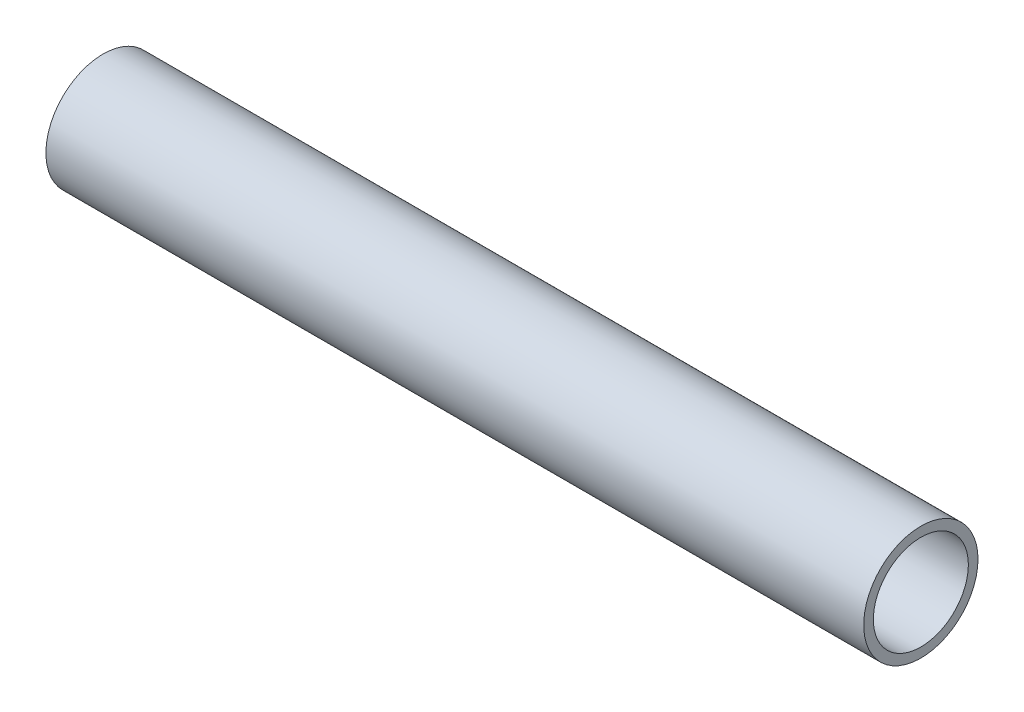
ISO-10303-21;
HEADER;
FILE_DESCRIPTION(('STEP AP214'),'2;1');
FILE_NAME('part.step','',(''),(''),'','','');
FILE_SCHEMA(('AUTOMOTIVE_DESIGN { 1 0 10303 214 1 1 1 1 }'));
ENDSEC;
DATA;
#1=APPLICATION_CONTEXT('core data for automotive mechanical design processes');
#2=APPLICATION_PROTOCOL_DEFINITION('international standard','automotive_design',2000,#1);
#3=PRODUCT_CONTEXT('',#1,'mechanical');
#4=PRODUCT('Part','Part','',(#3));
#5=PRODUCT_RELATED_PRODUCT_CATEGORY('part','',(#4));
#6=PRODUCT_DEFINITION_FORMATION('','',#4);
#7=PRODUCT_DEFINITION_CONTEXT('part definition',#1,'design');
#8=PRODUCT_DEFINITION('design','',#6,#7);
#9=PRODUCT_DEFINITION_SHAPE('','',#8);
#10=(LENGTH_UNIT() NAMED_UNIT(*) SI_UNIT(.MILLI.,.METRE.));
#11=(NAMED_UNIT(*) PLANE_ANGLE_UNIT() SI_UNIT($,.RADIAN.));
#12=(NAMED_UNIT(*) SI_UNIT($,.STERADIAN.) SOLID_ANGLE_UNIT());
#13=UNCERTAINTY_MEASURE_WITH_UNIT(LENGTH_MEASURE(1.E-05),#10,'distance_accuracy_value','');
#14=(GEOMETRIC_REPRESENTATION_CONTEXT(3) GLOBAL_UNCERTAINTY_ASSIGNED_CONTEXT((#13)) GLOBAL_UNIT_ASSIGNED_CONTEXT((#10,
#11,#12)) REPRESENTATION_CONTEXT('',''));
#15=CARTESIAN_POINT('',(0.,0.,0.));
#16=DIRECTION('',(0.,0.,1.));
#17=DIRECTION('',(1.,0.,0.));
#18=AXIS2_PLACEMENT_3D('',#15,#16,#17);
#19=CARTESIAN_POINT('',(-174.625,0.,0.));
#20=DIRECTION('',(1.,0.,0.));
#21=DIRECTION('',(0.,0.,-1.));
#22=AXIS2_PLACEMENT_3D('',#19,#20,#21);
#23=CYLINDRICAL_SURFACE('',#22,21.082);
#24=CARTESIAN_POINT('',(-95.25,0.,-21.082));
#25=CARTESIAN_POINT('',(-95.2500073037573,-0.177265588906064,-21.0819971511082));
#26=CARTESIAN_POINT('',(-95.2648956722781,-0.354633825443564,-21.0797407978607));
#27=CARTESIAN_POINT('',(-95.3240403602155,-0.704412011201185,-21.0709569196678));
#28=CARTESIAN_POINT('',(-95.3683252199961,-0.876816971803983,-21.064425243998));
#29=CARTESIAN_POINT('',(-95.4849091388346,-1.21155604974819,-21.0478246855302));
#30=CARTESIAN_POINT('',(-95.5571869641717,-1.37389769247853,-21.0377584843423));
#31=CARTESIAN_POINT('',(-95.7276530975323,-1.68412370373539,-21.0152009969064));
#32=CARTESIAN_POINT('',(-95.8258378289602,-1.83201006403648,-21.0027100454717));
#33=CARTESIAN_POINT('',(-96.0461542058056,-2.1103164343508,-20.9765819826565));
#34=CARTESIAN_POINT('',(-96.1684495601003,-2.24060616148058,-20.9629374218632));
#35=CARTESIAN_POINT('',(-96.4331633864275,-2.47889671955908,-20.9360982303561));
#36=CARTESIAN_POINT('',(-96.5755830188655,-2.58689626432783,-20.9229036256421));
#37=CARTESIAN_POINT('',(-96.8773786544134,-2.77804840978028,-20.8983859912104));
#38=CARTESIAN_POINT('',(-97.0368354067939,-2.86107486347092,-20.8870725883659));
#39=CARTESIAN_POINT('',(-97.3676295731584,-2.99911783525677,-20.8677000439257));
#40=CARTESIAN_POINT('',(-97.5389663337644,-3.05413589237424,-20.8596407235276));
#41=CARTESIAN_POINT('',(-97.8872863628436,-3.13419550245968,-20.8477621012251));
#42=CARTESIAN_POINT('',(-98.0642172558634,-3.15946016290709,-20.8439112577396));
#43=CARTESIAN_POINT('',(-98.419845943067,-3.17998699422211,-20.8407898425614));
#44=CARTESIAN_POINT('',(-98.5985436343971,-3.17525090142445,-20.8415190057945));
#45=CARTESIAN_POINT('',(-98.9510567099515,-3.13609297404926,-20.8474463775802));
#46=CARTESIAN_POINT('',(-99.1249004248299,-3.101919701057,-20.852607165254));
#47=CARTESIAN_POINT('',(-99.4643579756068,-3.00524659900985,-20.8667578327125));
#48=CARTESIAN_POINT('',(-99.6299715768266,-2.94274596272441,-20.8757478216156));
#49=CARTESIAN_POINT('',(-99.9490235812398,-2.7909340011809,-20.8965852461813));
#50=CARTESIAN_POINT('',(-100.102411162019,-2.70151746318004,-20.9084438587404));
#51=CARTESIAN_POINT('',(-100.392099144084,-2.498486828096,-20.9336742925736));
#52=CARTESIAN_POINT('',(-100.528398414064,-2.38487113028628,-20.9470462139227));
#53=CARTESIAN_POINT('',(-100.781481243325,-2.1353032656861,-20.9739618878806));
#54=CARTESIAN_POINT('',(-100.898054144489,-1.9991374095518,-20.9875060134767));
#55=CARTESIAN_POINT('',(-101.106725455512,-1.70906259522473,-21.0131148002247));
#56=CARTESIAN_POINT('',(-101.198823756631,-1.55515355820368,-21.0251794548033));
#57=CARTESIAN_POINT('',(-101.355942659601,-1.23377816277264,-21.0464826923882));
#58=CARTESIAN_POINT('',(-101.420946926471,-1.06630369822491,-21.0557195696406));
#59=CARTESIAN_POINT('',(-101.521848958346,-0.722645240857131,-21.070312259879));
#60=CARTESIAN_POINT('',(-101.557748707077,-0.546461842495156,-21.0756683373726));
#61=CARTESIAN_POINT('',(-101.599142333219,-0.192204765370484,-21.0818608911754));
#62=CARTESIAN_POINT('',(-101.604925808796,-0.0141656498471117,-21.0827404122035));
#63=CARTESIAN_POINT('',(-101.586691518388,0.340339952440575,-21.0799979514801));
#64=CARTESIAN_POINT('',(-101.562674682621,0.516806488119838,-21.0763761102388));
#65=CARTESIAN_POINT('',(-101.485762333879,0.862279899383912,-21.0650645063623));
#66=CARTESIAN_POINT('',(-101.433007989693,1.03131891039134,-21.0573946347692));
#67=CARTESIAN_POINT('',(-101.300267051749,1.35815274399449,-21.0388441665934));
#68=CARTESIAN_POINT('',(-101.220279170212,1.51594703443953,-21.0279634181826));
#69=CARTESIAN_POINT('',(-101.034662860785,1.8170851157619,-21.0040933283749));
#70=CARTESIAN_POINT('',(-100.928850826916,1.9603145348408,-20.9910891189132));
#71=CARTESIAN_POINT('',(-100.694845351182,2.22708618632573,-20.9644655933992));
#72=CARTESIAN_POINT('',(-100.566650597521,2.35062726403486,-20.9508462413297));
#73=CARTESIAN_POINT('',(-100.290229093112,2.57556977848285,-20.9243908347895));
#74=CARTESIAN_POINT('',(-100.141843493739,2.67677703259561,-20.9115622997957));
#75=CARTESIAN_POINT('',(-99.8300080053974,2.85282903090451,-20.888274456038));
#76=CARTESIAN_POINT('',(-99.6665585261644,2.92767449187153,-20.8778150828597));
#77=CARTESIAN_POINT('',(-99.3298127983176,3.04857772519442,-20.8605043047131));
#78=CARTESIAN_POINT('',(-99.156553855138,3.09473749350593,-20.8536401303661));
#79=CARTESIAN_POINT('',(-98.8046316089195,3.15728352894343,-20.8442630448294));
#80=CARTESIAN_POINT('',(-98.6259686832474,3.17367187018762,-20.8417498305174));
#81=CARTESIAN_POINT('',(-98.2702456638402,3.17616021106898,-20.8413705974415));
#82=CARTESIAN_POINT('',(-98.0931876803551,3.16256554437416,-20.8434577306442));
#83=CARTESIAN_POINT('',(-97.7439067922048,3.10612829026899,-20.8519421795031));
#84=CARTESIAN_POINT('',(-97.5716838795403,3.0632857512491,-20.8583394880282));
#85=CARTESIAN_POINT('',(-97.2370476835853,2.94967717748468,-20.874707044174));
#86=CARTESIAN_POINT('',(-97.0746269537971,2.87893265513937,-20.8846745386426));
#87=CARTESIAN_POINT('',(-96.7639105714977,2.71155871536682,-20.9070627102117));
#88=CARTESIAN_POINT('',(-96.6156154052644,2.61492840724794,-20.9194834717215));
#89=CARTESIAN_POINT('',(-96.3358087193127,2.39741725845485,-20.9455292166376));
#90=CARTESIAN_POINT('',(-96.2044739082908,2.27631033164997,-20.9591647100844));
#91=CARTESIAN_POINT('',(-95.9638828183518,2.01376149306829,-20.9860159394496));
#92=CARTESIAN_POINT('',(-95.8546316769312,1.87231486257537,-20.9992315770924));
#93=CARTESIAN_POINT('',(-95.6607669697578,1.57217776718591,-21.0238378848768));
#94=CARTESIAN_POINT('',(-95.5762935254673,1.41339594518084,-21.0352180180234));
#95=CARTESIAN_POINT('',(-95.4353412780308,1.08380087043067,-21.0547677779054));
#96=CARTESIAN_POINT('',(-95.3788335193363,0.913000272113382,-21.0629407235248));
#97=CARTESIAN_POINT('',(-95.3082168635909,0.61786433248082,-21.0732924950954));
#98=CARTESIAN_POINT('',(-95.2864189599853,0.495349503289427,-21.0765410154751));
#99=CARTESIAN_POINT('',(-95.2573080583054,0.248573261637359,-21.0808957533839));
#100=CARTESIAN_POINT('',(-95.2499948780599,0.124311871162614,-21.0820019978558));
#101=CARTESIAN_POINT('',(-95.25,0.,-21.082));
#102=B_SPLINE_CURVE_WITH_KNOTS('',3,(#24,#25,#26,#27,#28,#29,#30,#31,#32,#33,#34,#35,#36,#37,
#38,#39,#40,#41,#42,#43,#44,#45,#46,#47,#48,#49,#50,#51,#52,#53,#54,#55,#56,#57,#58,#59,#60,#61,
#62,#63,#64,#65,#66,#67,#68,#69,#70,#71,#72,#73,#74,#75,#76,#77,#78,#79,#80,#81,#82,#83,#84,#85,
#86,#87,#88,#89,#90,#91,#92,#93,#94,#95,#96,#97,#98,#99,#100,#101),.UNSPECIFIED.,.T.,.F.,(4,2,2,
2,2,2,2,2,2,2,2,2,2,2,2,2,2,2,2,2,2,2,2,2,2,2,2,2,2,2,2,2,2,2,2,2,2,2,4),(0.,0.531342512429038,
1.06320164882558,1.5946581376531,2.12604129424767,2.66116512439551,3.19631982343617,
3.73413403476704,4.27191869076775,4.80564452954641,5.33933947849273,5.86857170164552,
6.39781900700991,6.92916258470441,7.46054132064733,7.99727852314497,8.53401811031673,
9.07108083107699,9.6081069432693,10.1399593459211,10.6717951472021,11.2010416383702,
11.730313159249,12.2634633412738,12.7966447804,13.3342937698578,13.8719281396386,
14.4076397711918,14.9433140793118,15.4735585288678,16.0038021011393,16.5336376528597,
17.0634914377811,17.5984835709691,18.1336000206727,18.6716867332597,19.2092151415009,
19.5818368843675,19.9544539408189),.UNSPECIFIED.);
#103=CARTESIAN_POINT('',(-95.25,0.,-21.082));
#104=VERTEX_POINT('',#103);
#105=EDGE_CURVE('E75',#104,#104,#102,.T.);
#106=ORIENTED_EDGE('',*,*,#105,.F.);
#107=EDGE_LOOP('',(#106));
#108=FACE_BOUND('',#107,.T.);
#109=CARTESIAN_POINT('',(-146.05,0.,-21.082));
#110=CARTESIAN_POINT('',(-146.050007303757,-0.177265588906064,-21.0819971511082));
#111=CARTESIAN_POINT('',(-146.064895672278,-0.354633825443566,-21.0797407978607));
#112=CARTESIAN_POINT('',(-146.124040360215,-0.704412011201187,-21.0709569196678));
#113=CARTESIAN_POINT('',(-146.168325219996,-0.876816971803985,-21.064425243998));
#114=CARTESIAN_POINT('',(-146.284909138835,-1.21155604974819,-21.0478246855302));
#115=CARTESIAN_POINT('',(-146.357186964172,-1.37389769247854,-21.0377584843423));
#116=CARTESIAN_POINT('',(-146.527653097532,-1.6841237037354,-21.0152009969064));
#117=CARTESIAN_POINT('',(-146.62583782896,-1.8320100640365,-21.0027100454717));
#118=CARTESIAN_POINT('',(-146.846154205806,-2.11031643435081,-20.9765819826565));
#119=CARTESIAN_POINT('',(-146.9684495601,-2.24060616148059,-20.9629374218632));
#120=CARTESIAN_POINT('',(-147.233163386427,-2.47889671955909,-20.9360982303561));
#121=CARTESIAN_POINT('',(-147.375583018865,-2.58689626432784,-20.9229036256421));
#122=CARTESIAN_POINT('',(-147.677378654413,-2.77804840978029,-20.8983859912104));
#123=CARTESIAN_POINT('',(-147.836835406794,-2.86107486347093,-20.8870725883659));
#124=CARTESIAN_POINT('',(-148.167629573158,-2.99911783525678,-20.8677000439257));
#125=CARTESIAN_POINT('',(-148.338966333764,-3.05413589237425,-20.8596407235276));
#126=CARTESIAN_POINT('',(-148.687286362844,-3.13419550245969,-20.8477621012251));
#127=CARTESIAN_POINT('',(-148.864217255863,-3.15946016290709,-20.8439112577396));
#128=CARTESIAN_POINT('',(-149.219845943067,-3.17998699422211,-20.8407898425614));
#129=CARTESIAN_POINT('',(-149.398543634397,-3.17525090142445,-20.8415190057945));
#130=CARTESIAN_POINT('',(-149.751056709951,-3.13609297404926,-20.8474463775802));
#131=CARTESIAN_POINT('',(-149.92490042483,-3.101919701057,-20.852607165254));
#132=CARTESIAN_POINT('',(-150.264357975607,-3.00524659900985,-20.8667578327125));
#133=CARTESIAN_POINT('',(-150.429971576827,-2.9427459627244,-20.8757478216156));
#134=CARTESIAN_POINT('',(-150.74902358124,-2.79093400118089,-20.8965852461813));
#135=CARTESIAN_POINT('',(-150.902411162019,-2.70151746318001,-20.9084438587404));
#136=CARTESIAN_POINT('',(-151.192099144084,-2.49848682809597,-20.9336742925736));
#137=CARTESIAN_POINT('',(-151.328398414064,-2.38487113028625,-20.9470462139227));
#138=CARTESIAN_POINT('',(-151.581481243325,-2.13530326568607,-20.9739618878807));
#139=CARTESIAN_POINT('',(-151.698054144489,-1.99913740955177,-20.9875060134767));
#140=CARTESIAN_POINT('',(-151.906725455512,-1.70906259522471,-21.0131148002247));
#141=CARTESIAN_POINT('',(-151.998823756631,-1.55515355820366,-21.0251794548033));
#142=CARTESIAN_POINT('',(-152.155942659601,-1.23377816277263,-21.0464826923882));
#143=CARTESIAN_POINT('',(-152.220946926471,-1.0663036982249,-21.0557195696406));
#144=CARTESIAN_POINT('',(-152.321848958346,-0.722645240857127,-21.070312259879));
#145=CARTESIAN_POINT('',(-152.357748707077,-0.546461842495151,-21.0756683373726));
#146=CARTESIAN_POINT('',(-152.399142333219,-0.192204765370476,-21.0818608911754));
#147=CARTESIAN_POINT('',(-152.404925808796,-0.014165649847103,-21.0827404122035));
#148=CARTESIAN_POINT('',(-152.386691518388,0.340339952440583,-21.0799979514801));
#149=CARTESIAN_POINT('',(-152.362674682621,0.516806488119846,-21.0763761102388));
#150=CARTESIAN_POINT('',(-152.285762333879,0.86227989938392,-21.0650645063623));
#151=CARTESIAN_POINT('',(-152.233007989693,1.03131891039135,-21.0573946347692));
#152=CARTESIAN_POINT('',(-152.100267051749,1.3581527439945,-21.0388441665934));
#153=CARTESIAN_POINT('',(-152.020279170212,1.51594703443955,-21.0279634181826));
#154=CARTESIAN_POINT('',(-151.834662860785,1.8170851157619,-21.0040933283749));
#155=CARTESIAN_POINT('',(-151.728850826916,1.96031453484078,-20.9910891189132));
#156=CARTESIAN_POINT('',(-151.494845351182,2.22708618632572,-20.9644655933992));
#157=CARTESIAN_POINT('',(-151.366650597521,2.35062726403487,-20.9508462413297));
#158=CARTESIAN_POINT('',(-151.090229093112,2.57556977848286,-20.9243908347895));
#159=CARTESIAN_POINT('',(-150.941843493739,2.67677703259561,-20.9115622997957));
#160=CARTESIAN_POINT('',(-150.630008005397,2.8528290309045,-20.888274456038));
#161=CARTESIAN_POINT('',(-150.466558526164,2.92767449187153,-20.8778150828597));
#162=CARTESIAN_POINT('',(-150.129812798318,3.04857772519442,-20.8605043047131));
#163=CARTESIAN_POINT('',(-149.956553855138,3.09473749350594,-20.8536401303661));
#164=CARTESIAN_POINT('',(-149.604631608919,3.15728352894343,-20.8442630448294));
#165=CARTESIAN_POINT('',(-149.425968683247,3.17367187018762,-20.8417498305174));
#166=CARTESIAN_POINT('',(-149.07024566384,3.17616021106899,-20.8413705974415));
#167=CARTESIAN_POINT('',(-148.893187680355,3.16256554437416,-20.8434577306442));
#168=CARTESIAN_POINT('',(-148.543906792205,3.10612829026899,-20.8519421795031));
#169=CARTESIAN_POINT('',(-148.37168387954,3.0632857512491,-20.8583394880282));
#170=CARTESIAN_POINT('',(-148.037047683585,2.94967717748468,-20.874707044174));
#171=CARTESIAN_POINT('',(-147.874626953797,2.87893265513936,-20.8846745386426));
#172=CARTESIAN_POINT('',(-147.563910571498,2.71155871536682,-20.9070627102117));
#173=CARTESIAN_POINT('',(-147.415615405264,2.61492840724794,-20.9194834717215));
#174=CARTESIAN_POINT('',(-147.135808719313,2.39741725845485,-20.9455292166376));
#175=CARTESIAN_POINT('',(-147.004473908291,2.27631033164997,-20.9591647100844));
#176=CARTESIAN_POINT('',(-146.763882818352,2.01376149306828,-20.9860159394496));
#177=CARTESIAN_POINT('',(-146.654631676931,1.87231486257536,-20.9992315770924));
#178=CARTESIAN_POINT('',(-146.460766969758,1.57217776718591,-21.0238378848768));
#179=CARTESIAN_POINT('',(-146.376293525467,1.41339594518084,-21.0352180180234));
#180=CARTESIAN_POINT('',(-146.235341278031,1.08380087043067,-21.0547677779054));
#181=CARTESIAN_POINT('',(-146.178833519336,0.913000272113373,-21.0629407235248));
#182=CARTESIAN_POINT('',(-146.108216863591,0.617864332480807,-21.0732924950954));
#183=CARTESIAN_POINT('',(-146.086418959985,0.495349503289417,-21.0765410154751));
#184=CARTESIAN_POINT('',(-146.057308058305,0.248573261637354,-21.0808957533839));
#185=CARTESIAN_POINT('',(-146.04999487806,0.124311871162612,-21.0820019978558));
#186=CARTESIAN_POINT('',(-146.05,0.,-21.082));
#187=B_SPLINE_CURVE_WITH_KNOTS('',3,(#109,#110,#111,#112,#113,#114,#115,#116,#117,#118,#119,
#120,#121,#122,#123,#124,#125,#126,#127,#128,#129,#130,#131,#132,#133,#134,#135,#136,#137,#138,
#139,#140,#141,#142,#143,#144,#145,#146,#147,#148,#149,#150,#151,#152,#153,#154,#155,#156,#157,
#158,#159,#160,#161,#162,#163,#164,#165,#166,#167,#168,#169,#170,#171,#172,#173,#174,#175,#176,
#177,#178,#179,#180,#181,#182,#183,#184,#185,#186),.UNSPECIFIED.,.T.,.F.,(4,2,2,2,2,2,2,2,2,2,2,
2,2,2,2,2,2,2,2,2,2,2,2,2,2,2,2,2,2,2,2,2,2,2,2,2,2,2,4),(0.,0.53134251242904,1.06320164882559,
1.59465813765311,2.12604129424768,2.66116512439553,3.19631982343618,3.73413403476707,
4.27191869076778,4.80564452954643,5.33933947849274,5.86857170164554,6.39781900700992,
6.92916258470446,7.46054132064736,7.99727852314501,8.53401811031675,9.071080831077,
9.60810694326931,10.1399593459211,10.6717951472021,11.2010416383702,11.730313159249,
12.2634633412738,12.7966447804,13.3342937698578,13.8719281396386,14.4076397711918,
14.9433140793118,15.4735585288678,16.0038021011393,16.5336376528597,17.0634914377811,
17.5984835709691,18.1336000206728,18.6716867332597,19.2092151415009,19.5818368843675,
19.9544539408189),.UNSPECIFIED.);
#188=CARTESIAN_POINT('',(-146.05,0.,-21.082));
#189=VERTEX_POINT('',#188);
#190=EDGE_CURVE('E57',#189,#189,#187,.T.);
#191=ORIENTED_EDGE('',*,*,#190,.F.);
#192=EDGE_LOOP('',(#191));
#193=FACE_BOUND('',#192,.T.);
#194=CARTESIAN_POINT('',(-174.625,0.,0.));
#195=DIRECTION('',(1.,0.,0.));
#196=DIRECTION('',(0.,0.,-1.));
#197=AXIS2_PLACEMENT_3D('',#194,#195,#196);
#198=CIRCLE('',#197,21.082);
#199=CARTESIAN_POINT('',(-174.625,0.,-21.082));
#200=VERTEX_POINT('',#199);
#201=EDGE_CURVE('E10',#200,#200,#198,.T.);
#202=ORIENTED_EDGE('',*,*,#201,.T.);
#203=EDGE_LOOP('',(#202));
#204=FACE_BOUND('',#203,.T.);
#205=CARTESIAN_POINT('',(127.,0.,0.));
#206=DIRECTION('',(1.,0.,0.));
#207=DIRECTION('',(0.,0.,-1.));
#208=AXIS2_PLACEMENT_3D('',#205,#206,#207);
#209=CIRCLE('',#208,21.082);
#210=CARTESIAN_POINT('',(127.,0.,-21.082));
#211=VERTEX_POINT('',#210);
#212=EDGE_CURVE('E48',#211,#211,#209,.T.);
#213=ORIENTED_EDGE('',*,*,#212,.F.);
#214=EDGE_LOOP('',(#213));
#215=FACE_BOUND('',#214,.T.);
#216=ADVANCED_FACE('F30',(#108,#193,#204,#215),#23,.T.);
#217=CARTESIAN_POINT('',(-174.625,0.,0.));
#218=DIRECTION('',(1.,0.,0.));
#219=DIRECTION('',(0.,0.,-1.));
#220=AXIS2_PLACEMENT_3D('',#217,#218,#219);
#221=PLANE('',#220);
#222=CARTESIAN_POINT('',(-174.625,0.,0.));
#223=DIRECTION('',(1.,0.,0.));
#224=DIRECTION('',(0.,0.,-1.));
#225=AXIS2_PLACEMENT_3D('',#222,#223,#224);
#226=CIRCLE('',#225,17.526);
#227=CARTESIAN_POINT('',(-174.625,0.,-17.526));
#228=VERTEX_POINT('',#227);
#229=EDGE_CURVE('E43',#228,#228,#226,.T.);
#230=ORIENTED_EDGE('',*,*,#229,.T.);
#231=EDGE_LOOP('',(#230));
#232=FACE_BOUND('',#231,.T.);
#233=ORIENTED_EDGE('',*,*,#201,.F.);
#234=EDGE_LOOP('',(#233));
#235=FACE_BOUND('',#234,.T.);
#236=ADVANCED_FACE('F89',(#232,#235),#221,.F.);
#237=CARTESIAN_POINT('',(-174.625,0.,0.));
#238=DIRECTION('',(1.,0.,0.));
#239=DIRECTION('',(0.,0.,-1.));
#240=AXIS2_PLACEMENT_3D('',#237,#238,#239);
#241=CYLINDRICAL_SURFACE('',#240,17.526);
#242=CARTESIAN_POINT('',(-101.6,0.,-17.526));
#243=CARTESIAN_POINT('',(-101.599993132515,0.17679082350801,-17.5259968412274));
#244=CARTESIAN_POINT('',(-101.585183965731,0.353672270747988,-17.5232972774411));
#245=CARTESIAN_POINT('',(-101.526372438004,0.702458155041369,-17.5127883009458));
#246=CARTESIAN_POINT('',(-101.482344740396,0.874358137310072,-17.5049744534986));
#247=CARTESIAN_POINT('',(-101.366482418544,1.20808580036967,-17.485111731742));
#248=CARTESIAN_POINT('',(-101.29467216344,1.36992216434489,-17.4730665697294));
#249=CARTESIAN_POINT('',(-101.125350679922,1.67923272236702,-17.4460593997375));
#250=CARTESIAN_POINT('',(-101.027841801324,1.82670822784651,-17.4310976584752));
#251=CARTESIAN_POINT('',(-100.808729501993,2.10478127681952,-17.3997234174553));
#252=CARTESIAN_POINT('',(-100.686893953305,2.23519445696564,-17.3832978577657));
#253=CARTESIAN_POINT('',(-100.423086238519,2.47384671567764,-17.3509451203049));
#254=CARTESIAN_POINT('',(-100.281112684689,2.58208426483874,-17.3350179769725));
#255=CARTESIAN_POINT('',(-99.97976755925,2.77407084888639,-17.3053386524232));
#256=CARTESIAN_POINT('',(-99.82027574471,2.8576339824516,-17.2916033234658));
#257=CARTESIAN_POINT('',(-99.4892275026837,2.99671002667021,-17.2680459841376));
#258=CARTESIAN_POINT('',(-99.3176720447767,3.05222518866685,-17.2582236596927));
#259=CARTESIAN_POINT('',(-98.9693334205962,3.13304110203761,-17.2437354838221));
#260=CARTESIAN_POINT('',(-98.7926269370351,3.15866238598856,-17.2390149702052));
#261=CARTESIAN_POINT('',(-98.4373650062532,3.17995782064228,-17.235099927382));
#262=CARTESIAN_POINT('',(-98.2588097149559,3.1756344765814,-17.2359049358977));
#263=CARTESIAN_POINT('',(-97.9072300510038,3.13742365897766,-17.2429001682717));
#264=CARTESIAN_POINT('',(-97.7341647086679,3.10389926153133,-17.2490242538492));
#265=CARTESIAN_POINT('',(-97.3961562140921,3.00880912932249,-17.2658638407267));
#266=CARTESIAN_POINT('',(-97.231213386391,2.94724227511612,-17.2765795253205));
#267=CARTESIAN_POINT('',(-96.9130619363625,2.79745571266688,-17.3014647929721));
#268=CARTESIAN_POINT('',(-96.7599245079335,2.7090880872545,-17.3156534578234));
#269=CARTESIAN_POINT('',(-96.470514150003,2.50831315208051,-17.3458731721502));
#270=CARTESIAN_POINT('',(-96.3342428236547,2.39590355985285,-17.3619043964854));
#271=CARTESIAN_POINT('',(-96.0803338962992,2.14827149301383,-17.3942918762038));
#272=CARTESIAN_POINT('',(-95.962999429291,2.01273815664841,-17.4106494468318));
#273=CARTESIAN_POINT('',(-95.7526886211131,1.72374960651158,-17.4416297211863));
#274=CARTESIAN_POINT('',(-95.6597124943575,1.57029423499867,-17.4562524096409));
#275=CARTESIAN_POINT('',(-95.500718396598,1.24951132270804,-17.4821419521182));
#276=CARTESIAN_POINT('',(-95.4347304486683,1.08216858038397,-17.4934050650234));
#277=CARTESIAN_POINT('',(-95.3318843483637,0.738524824278316,-17.5112771866033));
#278=CARTESIAN_POINT('',(-95.2950233103667,0.562224699752744,-17.5178866563105));
#279=CARTESIAN_POINT('',(-95.2518958271967,0.208280155645573,-17.5256438790602));
#280=CARTESIAN_POINT('',(-95.245213792981,0.0306879466818638,-17.5268658171028));
#281=CARTESIAN_POINT('',(-95.2615213711922,-0.323076767936696,-17.5239146703191));
#282=CARTESIAN_POINT('',(-95.2845096264779,-0.499249338156001,-17.5197418322538));
#283=CARTESIAN_POINT('',(-95.3591596423848,-0.843866600411555,-17.5065161011469));
#284=CARTESIAN_POINT('',(-95.4106125479722,-1.01235801735561,-17.4974987676082));
#285=CARTESIAN_POINT('',(-95.5405063595171,-1.33832313012139,-17.4755909179164));
#286=CARTESIAN_POINT('',(-95.6189490011885,-1.49579611656221,-17.4627001526692));
#287=CARTESIAN_POINT('',(-95.8015255027009,-1.7970379428255,-17.4342904171948));
#288=CARTESIAN_POINT('',(-95.9059150975122,-1.94064931955918,-17.4187457992515));
#289=CARTESIAN_POINT('',(-96.1370744185283,-2.20846506883692,-17.3868220571775));
#290=CARTESIAN_POINT('',(-96.2638460863583,-2.33266775593063,-17.3704428607355));
#291=CARTESIAN_POINT('',(-96.5380470534088,-2.55970748627499,-17.3384518393717));
#292=CARTESIAN_POINT('',(-96.6857120955064,-2.66226178053651,-17.3228519867864));
#293=CARTESIAN_POINT('',(-96.9964178334415,-2.84110984177048,-17.2944212278246));
#294=CARTESIAN_POINT('',(-97.1594579820262,-2.91740454296296,-17.2815902229488));
#295=CARTESIAN_POINT('',(-97.4955450343434,-3.04115979533501,-17.2602426012819));
#296=CARTESIAN_POINT('',(-97.6685416025097,-3.08875345587471,-17.2517060985603));
#297=CARTESIAN_POINT('',(-98.0202437321866,-3.15416897697809,-17.2398671271274));
#298=CARTESIAN_POINT('',(-98.1989486950753,-3.17199394891527,-17.2365641114227));
#299=CARTESIAN_POINT('',(-98.5541655418571,-3.17726742876193,-17.2355925385196));
#300=CARTESIAN_POINT('',(-98.7306707384355,-3.16516161695717,-17.2378413124165));
#301=CARTESIAN_POINT('',(-99.0790866320758,-3.11188910689162,-17.2475373034534));
#302=CARTESIAN_POINT('',(-99.2509973523558,-3.07072255551699,-17.2549844943182));
#303=CARTESIAN_POINT('',(-99.5851258972035,-2.96067981082377,-17.2742044563146));
#304=CARTESIAN_POINT('',(-99.7473590229442,-2.89184876708741,-17.2859701767276));
#305=CARTESIAN_POINT('',(-100.058046204287,-2.72847862049299,-17.3125070165183));
#306=CARTESIAN_POINT('',(-100.20649937582,-2.633937869728,-17.3272783285292));
#307=CARTESIAN_POINT('',(-100.487651300551,-2.42026944589855,-17.3584203635157));
#308=CARTESIAN_POINT('',(-100.620100559389,-2.30081626698696,-17.37481057328));
#309=CARTESIAN_POINT('',(-100.86322420719,-2.04139533634304,-17.4071948659678));
#310=CARTESIAN_POINT('',(-100.973893583025,-1.90142287454245,-17.4231888569539));
#311=CARTESIAN_POINT('',(-101.171171023297,-1.60354404533997,-17.4531342301883));
#312=CARTESIAN_POINT('',(-101.257571193469,-1.44549813095465,-17.4670675069251));
#313=CARTESIAN_POINT('',(-101.402456942508,-1.11693687333548,-17.4911451342375));
#314=CARTESIAN_POINT('',(-101.460969245347,-0.946433648982045,-17.5012931100993));
#315=CARTESIAN_POINT('',(-101.536276479759,-0.646146664812306,-17.5145413811557));
#316=CARTESIAN_POINT('',(-101.560132786512,-0.518138865968811,-17.5188145120769));
#317=CARTESIAN_POINT('',(-101.591996893811,-0.26010370060993,-17.5245449517082));
#318=CARTESIAN_POINT('',(-101.600005052851,-0.130076379844328,-17.5260023241122));
#319=CARTESIAN_POINT('',(-101.6,0.,-17.526));
#320=B_SPLINE_CURVE_WITH_KNOTS('',3,(#242,#243,#244,#245,#246,#247,#248,#249,#250,#251,#252,
#253,#254,#255,#256,#257,#258,#259,#260,#261,#262,#263,#264,#265,#266,#267,#268,#269,#270,#271,
#272,#273,#274,#275,#276,#277,#278,#279,#280,#281,#282,#283,#284,#285,#286,#287,#288,#289,#290,
#291,#292,#293,#294,#295,#296,#297,#298,#299,#300,#301,#302,#303,#304,#305,#306,#307,#308,#309,
#310,#311,#312,#313,#314,#315,#316,#317,#318,#319),.UNSPECIFIED.,.T.,.F.,(4,2,2,2,2,2,2,2,2,2,2,
2,2,2,2,2,2,2,2,2,2,2,2,2,2,2,2,2,2,2,2,2,2,2,2,2,2,2,4),(0.,0.52989684739867,1.06025379298761,
1.59014659312776,2.11999095802632,2.65515610450925,3.19035814774705,3.7294952286848,
4.26858902750702,4.80184775131232,5.33506186200683,5.86173930617047,6.38843777693352,
6.91809776769747,7.4478080649945,7.985299753981,8.52279617407827,9.06088891772033,
9.59892834547637,10.1295354893394,10.6601183636945,11.1868588327276,11.713633182854,
12.2458209999474,12.778055006572,13.3168607871052,13.8556473969222,14.3919156166157,
14.9281277829441,15.4564037756751,15.9846770982784,16.5120917356115,17.0395401864443,
17.5743685624972,18.1093198977251,18.6487229234539,19.1876080135939,19.5774960261897,
19.9673752191978),.UNSPECIFIED.);
#321=CARTESIAN_POINT('',(-101.6,0.,-17.526));
#322=VERTEX_POINT('',#321);
#323=EDGE_CURVE('E34',#322,#322,#320,.T.);
#324=ORIENTED_EDGE('',*,*,#323,.T.);
#325=EDGE_LOOP('',(#324));
#326=FACE_BOUND('',#325,.T.);
#327=CARTESIAN_POINT('',(-152.4,0.,-17.526));
#328=CARTESIAN_POINT('',(-152.399993132515,0.176790823508009,-17.5259968412274));
#329=CARTESIAN_POINT('',(-152.385183965731,0.353672270747985,-17.5232972774411));
#330=CARTESIAN_POINT('',(-152.326372438004,0.702458155041367,-17.5127883009458));
#331=CARTESIAN_POINT('',(-152.282344740396,0.874358137310074,-17.5049744534986));
#332=CARTESIAN_POINT('',(-152.166482418544,1.20808580036968,-17.485111731742));
#333=CARTESIAN_POINT('',(-152.09467216344,1.3699221643449,-17.4730665697294));
#334=CARTESIAN_POINT('',(-151.925350679922,1.67923272236704,-17.4460593997375));
#335=CARTESIAN_POINT('',(-151.827841801324,1.82670822784652,-17.4310976584752));
#336=CARTESIAN_POINT('',(-151.608729501993,2.10478127681953,-17.3997234174553));
#337=CARTESIAN_POINT('',(-151.486893953305,2.23519445696565,-17.3832978577657));
#338=CARTESIAN_POINT('',(-151.223086238519,2.47384671567765,-17.3509451203049));
#339=CARTESIAN_POINT('',(-151.081112684689,2.58208426483874,-17.3350179769725));
#340=CARTESIAN_POINT('',(-150.77976755925,2.77407084888639,-17.3053386524232));
#341=CARTESIAN_POINT('',(-150.62027574471,2.8576339824516,-17.2916033234658));
#342=CARTESIAN_POINT('',(-150.289227502684,2.99671002667021,-17.2680459841376));
#343=CARTESIAN_POINT('',(-150.117672044777,3.05222518866685,-17.2582236596927));
#344=CARTESIAN_POINT('',(-149.769333420596,3.13304110203761,-17.2437354838221));
#345=CARTESIAN_POINT('',(-149.592626937035,3.15866238598857,-17.2390149702052));
#346=CARTESIAN_POINT('',(-149.237365006253,3.17995782064228,-17.235099927382));
#347=CARTESIAN_POINT('',(-149.058809714956,3.1756344765814,-17.2359049358977));
#348=CARTESIAN_POINT('',(-148.707230051004,3.13742365897766,-17.2429001682717));
#349=CARTESIAN_POINT('',(-148.534164708668,3.10389926153133,-17.2490242538492));
#350=CARTESIAN_POINT('',(-148.196156214092,3.00880912932248,-17.2658638407267));
#351=CARTESIAN_POINT('',(-148.031213386391,2.94724227511611,-17.2765795253205));
#352=CARTESIAN_POINT('',(-147.713061936362,2.79745571266685,-17.3014647929721));
#353=CARTESIAN_POINT('',(-147.559924507933,2.70908808725447,-17.3156534578234));
#354=CARTESIAN_POINT('',(-147.270514150003,2.50831315208049,-17.3458731721502));
#355=CARTESIAN_POINT('',(-147.134242823655,2.39590355985283,-17.3619043964854));
#356=CARTESIAN_POINT('',(-146.880333896299,2.14827149301382,-17.3942918762038));
#357=CARTESIAN_POINT('',(-146.762999429291,2.01273815664841,-17.4106494468318));
#358=CARTESIAN_POINT('',(-146.552688621113,1.72374960651158,-17.4416297211863));
#359=CARTESIAN_POINT('',(-146.459712494357,1.57029423499867,-17.4562524096409));
#360=CARTESIAN_POINT('',(-146.300718396598,1.24951132270804,-17.4821419521182));
#361=CARTESIAN_POINT('',(-146.234730448668,1.08216858038396,-17.4934050650234));
#362=CARTESIAN_POINT('',(-146.131884348364,0.738524824278307,-17.5112771866033));
#363=CARTESIAN_POINT('',(-146.095023310367,0.562224699752732,-17.5178866563105));
#364=CARTESIAN_POINT('',(-146.051895827197,0.208280155645558,-17.5256438790602));
#365=CARTESIAN_POINT('',(-146.045213792981,0.0306879466818504,-17.5268658171028));
#366=CARTESIAN_POINT('',(-146.061521371192,-0.323076767936705,-17.5239146703191));
#367=CARTESIAN_POINT('',(-146.084509626478,-0.499249338156009,-17.5197418322538));
#368=CARTESIAN_POINT('',(-146.159159642385,-0.843866600411558,-17.5065161011469));
#369=CARTESIAN_POINT('',(-146.210612547972,-1.01235801735561,-17.4974987676082));
#370=CARTESIAN_POINT('',(-146.340506359517,-1.3383231301214,-17.4755909179164));
#371=CARTESIAN_POINT('',(-146.418949001188,-1.49579611656221,-17.4627001526692));
#372=CARTESIAN_POINT('',(-146.601525502701,-1.79703794282551,-17.4342904171948));
#373=CARTESIAN_POINT('',(-146.705915097512,-1.94064931955918,-17.4187457992515));
#374=CARTESIAN_POINT('',(-146.937074418528,-2.20846506883692,-17.3868220571775));
#375=CARTESIAN_POINT('',(-147.063846086358,-2.33266775593063,-17.3704428607355));
#376=CARTESIAN_POINT('',(-147.338047053409,-2.559707486275,-17.3384518393717));
#377=CARTESIAN_POINT('',(-147.485712095506,-2.66226178053653,-17.3228519867864));
#378=CARTESIAN_POINT('',(-147.796417833441,-2.84110984177049,-17.2944212278246));
#379=CARTESIAN_POINT('',(-147.959457982026,-2.91740454296297,-17.2815902229488));
#380=CARTESIAN_POINT('',(-148.295545034343,-3.04115979533501,-17.2602426012819));
#381=CARTESIAN_POINT('',(-148.46854160251,-3.08875345587471,-17.2517060985603));
#382=CARTESIAN_POINT('',(-148.820243732187,-3.1541689769781,-17.2398671271274));
#383=CARTESIAN_POINT('',(-148.998948695075,-3.17199394891528,-17.2365641114227));
#384=CARTESIAN_POINT('',(-149.354165541857,-3.17726742876193,-17.2355925385196));
#385=CARTESIAN_POINT('',(-149.530670738435,-3.16516161695717,-17.2378413124165));
#386=CARTESIAN_POINT('',(-149.879086632076,-3.11188910689162,-17.2475373034534));
#387=CARTESIAN_POINT('',(-150.050997352356,-3.07072255551698,-17.2549844943182));
#388=CARTESIAN_POINT('',(-150.385125897204,-2.96067981082376,-17.2742044563146));
#389=CARTESIAN_POINT('',(-150.547359022944,-2.8918487670874,-17.2859701767276));
#390=CARTESIAN_POINT('',(-150.858046204287,-2.72847862049297,-17.3125070165183));
#391=CARTESIAN_POINT('',(-151.00649937582,-2.63393786972798,-17.3272783285293));
#392=CARTESIAN_POINT('',(-151.287651300551,-2.42026944589853,-17.3584203635157));
#393=CARTESIAN_POINT('',(-151.420100559389,-2.30081626698695,-17.37481057328));
#394=CARTESIAN_POINT('',(-151.66322420719,-2.04139533634303,-17.4071948659678));
#395=CARTESIAN_POINT('',(-151.773893583025,-1.90142287454244,-17.4231888569539));
#396=CARTESIAN_POINT('',(-151.971171023297,-1.60354404533996,-17.4531342301883));
#397=CARTESIAN_POINT('',(-152.057571193469,-1.44549813095464,-17.4670675069251));
#398=CARTESIAN_POINT('',(-152.202456942508,-1.11693687333546,-17.4911451342375));
#399=CARTESIAN_POINT('',(-152.260969245347,-0.946433648982028,-17.5012931100993));
#400=CARTESIAN_POINT('',(-152.336276479759,-0.646146664812287,-17.5145413811557));
#401=CARTESIAN_POINT('',(-152.360132786512,-0.518138865968793,-17.5188145120769));
#402=CARTESIAN_POINT('',(-152.391996893811,-0.260103700609919,-17.5245449517082));
#403=CARTESIAN_POINT('',(-152.400005052851,-0.130076379844322,-17.5260023241122));
#404=CARTESIAN_POINT('',(-152.4,0.,-17.526));
#405=B_SPLINE_CURVE_WITH_KNOTS('',3,(#327,#328,#329,#330,#331,#332,#333,#334,#335,#336,#337,
#338,#339,#340,#341,#342,#343,#344,#345,#346,#347,#348,#349,#350,#351,#352,#353,#354,#355,#356,
#357,#358,#359,#360,#361,#362,#363,#364,#365,#366,#367,#368,#369,#370,#371,#372,#373,#374,#375,
#376,#377,#378,#379,#380,#381,#382,#383,#384,#385,#386,#387,#388,#389,#390,#391,#392,#393,#394,
#395,#396,#397,#398,#399,#400,#401,#402,#403,#404),.UNSPECIFIED.,.T.,.F.,(4,2,2,2,2,2,2,2,2,2,2,
2,2,2,2,2,2,2,2,2,2,2,2,2,2,2,2,2,2,2,2,2,2,2,2,2,2,2,4),(0.,0.52989684739867,1.06025379298762,
1.59014659312777,2.11999095802633,2.65515610450925,3.19035814774706,3.72949522868482,
4.26858902750703,4.80184775131235,5.33506186200683,5.86173930617047,6.3884377769336,
6.91809776769754,7.44780806499452,7.985299753981,8.52279617407827,9.06088891772035,
9.59892834547639,10.1295354893394,10.6601183636946,11.1868588327276,11.713633182854,
12.2458209999474,12.778055006572,13.3168607871052,13.8556473969223,14.3919156166158,
14.9281277829441,15.4564037756751,15.9846770982785,16.5120917356116,17.0395401864443,
17.5743685624972,18.1093198977252,18.648722923454,19.1876080135939,19.5774960261897,
19.9673752191978),.UNSPECIFIED.);
#406=CARTESIAN_POINT('',(-152.4,0.,-17.526));
#407=VERTEX_POINT('',#406);
#408=EDGE_CURVE('E51',#407,#407,#405,.T.);
#409=ORIENTED_EDGE('',*,*,#408,.T.);
#410=EDGE_LOOP('',(#409));
#411=FACE_BOUND('',#410,.T.);
#412=ORIENTED_EDGE('',*,*,#229,.F.);
#413=EDGE_LOOP('',(#412));
#414=FACE_BOUND('',#413,.T.);
#415=CARTESIAN_POINT('',(127.,0.,0.));
#416=DIRECTION('',(1.,0.,0.));
#417=DIRECTION('',(0.,0.,-1.));
#418=AXIS2_PLACEMENT_3D('',#415,#416,#417);
#419=CIRCLE('',#418,17.526);
#420=CARTESIAN_POINT('',(127.,0.,-17.526));
#421=VERTEX_POINT('',#420);
#422=EDGE_CURVE('E81',#421,#421,#419,.T.);
#423=ORIENTED_EDGE('',*,*,#422,.T.);
#424=EDGE_LOOP('',(#423));
#425=FACE_BOUND('',#424,.T.);
#426=ADVANCED_FACE('F58',(#326,#411,#414,#425),#241,.F.);
#427=CARTESIAN_POINT('',(127.,0.,0.));
#428=DIRECTION('',(1.,0.,0.));
#429=DIRECTION('',(0.,0.,-1.));
#430=AXIS2_PLACEMENT_3D('',#427,#428,#429);
#431=PLANE('',#430);
#432=ORIENTED_EDGE('',*,*,#212,.T.);
#433=EDGE_LOOP('',(#432));
#434=FACE_BOUND('',#433,.T.);
#435=ORIENTED_EDGE('',*,*,#422,.F.);
#436=EDGE_LOOP('',(#435));
#437=FACE_BOUND('',#436,.T.);
#438=ADVANCED_FACE('F65',(#434,#437),#431,.T.);
#439=CARTESIAN_POINT('',(-149.225,0.,-21.082));
#440=DIRECTION('',(0.,0.,1.));
#441=DIRECTION('',(1.,0.,0.));
#442=AXIS2_PLACEMENT_3D('',#439,#440,#441);
#443=CYLINDRICAL_SURFACE('',#442,3.17500000000009);
#444=ORIENTED_EDGE('',*,*,#190,.T.);
#445=EDGE_LOOP('',(#444));
#446=FACE_BOUND('',#445,.T.);
#447=ORIENTED_EDGE('',*,*,#408,.F.);
#448=EDGE_LOOP('',(#447));
#449=FACE_BOUND('',#448,.T.);
#450=ADVANCED_FACE('F61',(#446,#449),#443,.F.);
#451=CARTESIAN_POINT('',(-98.4250000000001,0.,-21.082));
#452=DIRECTION('',(0.,0.,1.));
#453=DIRECTION('',(1.,0.,0.));
#454=AXIS2_PLACEMENT_3D('',#451,#452,#453);
#455=CYLINDRICAL_SURFACE('',#454,3.17500000000008);
#456=ORIENTED_EDGE('',*,*,#105,.T.);
#457=EDGE_LOOP('',(#456));
#458=FACE_BOUND('',#457,.T.);
#459=ORIENTED_EDGE('',*,*,#323,.F.);
#460=EDGE_LOOP('',(#459));
#461=FACE_BOUND('',#460,.T.);
#462=ADVANCED_FACE('F64',(#458,#461),#455,.F.);
#463=CLOSED_SHELL('',(#216,#236,#426,#438,#450,#462));
#464=MANIFOLD_SOLID_BREP('B2',#463);
#465=ADVANCED_BREP_SHAPE_REPRESENTATION('',(#18,#464),#14);
#466=SHAPE_DEFINITION_REPRESENTATION(#9,#465);
ENDSEC;
END-ISO-10303-21;
